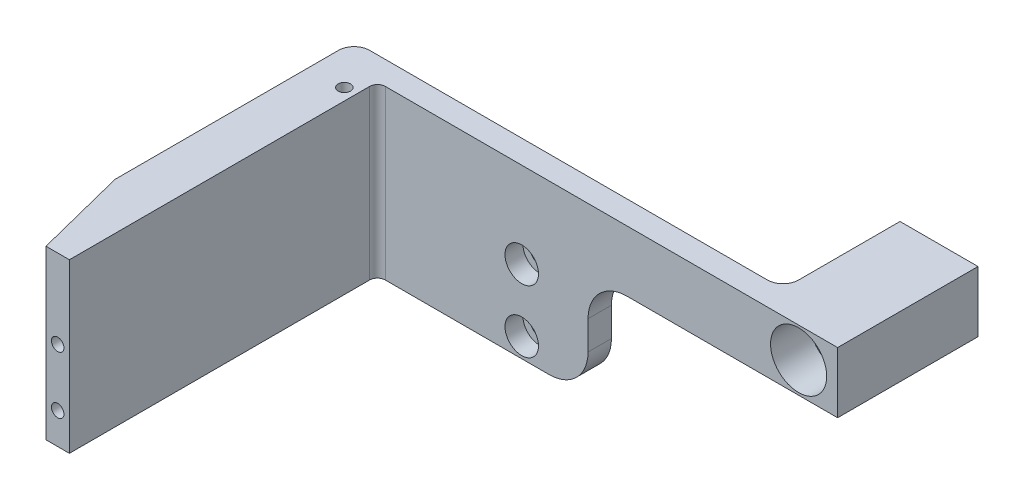
ISO-10303-21;
HEADER;
FILE_DESCRIPTION(('STEP AP214'),'2;1');
FILE_NAME('part.step','',(''),(''),'','','');
FILE_SCHEMA(('AUTOMOTIVE_DESIGN { 1 0 10303 214 1 1 1 1 }'));
ENDSEC;
DATA;
#1=APPLICATION_CONTEXT('core data for automotive mechanical design processes');
#2=APPLICATION_PROTOCOL_DEFINITION('international standard','automotive_design',2000,#1);
#3=PRODUCT_CONTEXT('',#1,'mechanical');
#4=PRODUCT('Part','Part','',(#3));
#5=PRODUCT_RELATED_PRODUCT_CATEGORY('part','',(#4));
#6=PRODUCT_DEFINITION_FORMATION('','',#4);
#7=PRODUCT_DEFINITION_CONTEXT('part definition',#1,'design');
#8=PRODUCT_DEFINITION('design','',#6,#7);
#9=PRODUCT_DEFINITION_SHAPE('','',#8);
#10=(LENGTH_UNIT() NAMED_UNIT(*) SI_UNIT(.MILLI.,.METRE.));
#11=(NAMED_UNIT(*) PLANE_ANGLE_UNIT() SI_UNIT($,.RADIAN.));
#12=(NAMED_UNIT(*) SI_UNIT($,.STERADIAN.) SOLID_ANGLE_UNIT());
#13=UNCERTAINTY_MEASURE_WITH_UNIT(LENGTH_MEASURE(1.E-05),#10,'distance_accuracy_value','');
#14=(GEOMETRIC_REPRESENTATION_CONTEXT(3) GLOBAL_UNCERTAINTY_ASSIGNED_CONTEXT((#13)) GLOBAL_UNIT_ASSIGNED_CONTEXT((#10,
#11,#12)) REPRESENTATION_CONTEXT('',''));
#15=CARTESIAN_POINT('',(0.,0.,0.));
#16=DIRECTION('',(0.,0.,1.));
#17=DIRECTION('',(1.,0.,0.));
#18=AXIS2_PLACEMENT_3D('',#15,#16,#17);
#19=CARTESIAN_POINT('',(0.,0.,3.));
#20=DIRECTION('',(0.,0.,1.));
#21=DIRECTION('',(1.,0.,0.));
#22=AXIS2_PLACEMENT_3D('',#19,#20,#21);
#23=PLANE('',#22);
#24=DIRECTION('',(-1.,0.,0.));
#25=VECTOR('',#24,1.);
#26=CARTESIAN_POINT('',(0.,-6.5,3.));
#27=LINE('',#26,#25);
#28=CARTESIAN_POINT('',(15.,-6.5,3.));
#29=VERTEX_POINT('',#28);
#30=CARTESIAN_POINT('',(-5.99999999999999,-6.5,3.));
#31=VERTEX_POINT('',#30);
#32=EDGE_CURVE('E311',#29,#31,#27,.T.);
#33=ORIENTED_EDGE('',*,*,#32,.F.);
#34=CARTESIAN_POINT('',(15.,-1.5,3.));
#35=DIRECTION('',(0.,0.,1.));
#36=DIRECTION('',(1.,0.,0.));
#37=AXIS2_PLACEMENT_3D('',#34,#35,#36);
#38=CIRCLE('',#37,5.);
#39=CARTESIAN_POINT('',(20.,-1.5,3.));
#40=VERTEX_POINT('',#39);
#41=EDGE_CURVE('E415',#29,#40,#38,.T.);
#42=ORIENTED_EDGE('',*,*,#41,.T.);
#43=DIRECTION('',(0.,-1.,0.));
#44=VECTOR('',#43,1.);
#45=CARTESIAN_POINT('',(20.,0.,3.));
#46=LINE('',#45,#44);
#47=CARTESIAN_POINT('',(20.,2.2,3.));
#48=VERTEX_POINT('',#47);
#49=EDGE_CURVE('E243',#48,#40,#46,.T.);
#50=ORIENTED_EDGE('',*,*,#49,.F.);
#51=CARTESIAN_POINT('',(25.,2.2,3.));
#52=DIRECTION('',(0.,0.,1.));
#53=DIRECTION('',(1.,0.,0.));
#54=AXIS2_PLACEMENT_3D('',#51,#52,#53);
#55=CIRCLE('',#54,5.);
#56=CARTESIAN_POINT('',(25.,7.2,3.));
#57=VERTEX_POINT('',#56);
#58=EDGE_CURVE('E11',#48,#57,#55,.F.);
#59=ORIENTED_EDGE('',*,*,#58,.T.);
#60=DIRECTION('',(-1.,0.,0.));
#61=VECTOR('',#60,1.);
#62=CARTESIAN_POINT('',(52.,7.2,3.));
#63=LINE('',#62,#61);
#64=CARTESIAN_POINT('',(52.,7.2,3.));
#65=VERTEX_POINT('',#64);
#66=EDGE_CURVE('E305',#65,#57,#63,.T.);
#67=ORIENTED_EDGE('',*,*,#66,.F.);
#68=DIRECTION('',(0.,-1.,0.));
#69=VECTOR('',#68,1.);
#70=CARTESIAN_POINT('',(52.,15.,3.));
#71=LINE('',#70,#69);
#72=CARTESIAN_POINT('',(52.,15.,3.));
#73=VERTEX_POINT('',#72);
#74=EDGE_CURVE('E295',#73,#65,#71,.T.);
#75=ORIENTED_EDGE('',*,*,#74,.F.);
#76=DIRECTION('',(1.,0.,0.));
#77=VECTOR('',#76,1.);
#78=CARTESIAN_POINT('',(20.,15.,3.));
#79=LINE('',#78,#77);
#80=CARTESIAN_POINT('',(-5.99999999999999,15.,3.));
#81=VERTEX_POINT('',#80);
#82=EDGE_CURVE('E351',#81,#73,#79,.T.);
#83=ORIENTED_EDGE('',*,*,#82,.F.);
#84=DIRECTION('',(0.,1.,0.));
#85=VECTOR('',#84,1.);
#86=CARTESIAN_POINT('',(-5.99999999999999,0.,3.));
#87=LINE('',#86,#85);
#88=EDGE_CURVE('E363',#81,#31,#87,.F.);
#89=ORIENTED_EDGE('',*,*,#88,.T.);
#90=EDGE_LOOP('',(#33,#42,#50,#59,#67,#75,#83,#89));
#91=FACE_BOUND('',#90,.T.);
#92=CARTESIAN_POINT('',(47.,11.1,3.));
#93=DIRECTION('',(0.,0.,1.));
#94=DIRECTION('',(1.,0.,0.));
#95=AXIS2_PLACEMENT_3D('',#92,#93,#94);
#96=CIRCLE('',#95,3.6);
#97=CARTESIAN_POINT('',(50.6,11.1,3.));
#98=VERTEX_POINT('',#97);
#99=EDGE_CURVE('E254',#98,#98,#96,.T.);
#100=ORIENTED_EDGE('',*,*,#99,.F.);
#101=EDGE_LOOP('',(#100));
#102=FACE_BOUND('',#101,.T.);
#103=CARTESIAN_POINT('',(11.5,4.,3.));
#104=DIRECTION('',(0.,0.,1.));
#105=DIRECTION('',(1.,0.,0.));
#106=AXIS2_PLACEMENT_3D('',#103,#104,#105);
#107=CIRCLE('',#106,2.15);
#108=CARTESIAN_POINT('',(13.65,4.,3.));
#109=VERTEX_POINT('',#108);
#110=EDGE_CURVE('E322',#109,#109,#107,.T.);
#111=ORIENTED_EDGE('',*,*,#110,.F.);
#112=EDGE_LOOP('',(#111));
#113=FACE_BOUND('',#112,.T.);
#114=CARTESIAN_POINT('',(11.5,-4.,3.));
#115=DIRECTION('',(0.,0.,1.));
#116=DIRECTION('',(1.,0.,0.));
#117=AXIS2_PLACEMENT_3D('',#114,#115,#116);
#118=CIRCLE('',#117,2.15);
#119=CARTESIAN_POINT('',(13.65,-4.,3.));
#120=VERTEX_POINT('',#119);
#121=EDGE_CURVE('E335',#120,#120,#118,.T.);
#122=ORIENTED_EDGE('',*,*,#121,.F.);
#123=EDGE_LOOP('',(#122));
#124=FACE_BOUND('',#123,.T.);
#125=ADVANCED_FACE('F46',(#91,#102,#113,#124),#23,.T.);
#126=CARTESIAN_POINT('',(0.,0.,0.));
#127=DIRECTION('',(0.,0.,1.));
#128=DIRECTION('',(1.,0.,0.));
#129=AXIS2_PLACEMENT_3D('',#126,#127,#128);
#130=PLANE('',#129);
#131=CARTESIAN_POINT('',(11.5,-4.,0.));
#132=DIRECTION('',(0.,0.,1.));
#133=DIRECTION('',(1.,0.,0.));
#134=AXIS2_PLACEMENT_3D('',#131,#132,#133);
#135=CIRCLE('',#134,1.2);
#136=CARTESIAN_POINT('',(12.7,-4.,0.));
#137=VERTEX_POINT('',#136);
#138=EDGE_CURVE('E346',#137,#137,#135,.T.);
#139=ORIENTED_EDGE('',*,*,#138,.T.);
#140=EDGE_LOOP('',(#139));
#141=FACE_BOUND('',#140,.T.);
#142=CARTESIAN_POINT('',(11.5,4.,0.));
#143=DIRECTION('',(0.,0.,1.));
#144=DIRECTION('',(1.,0.,0.));
#145=AXIS2_PLACEMENT_3D('',#142,#143,#144);
#146=CIRCLE('',#145,1.2);
#147=CARTESIAN_POINT('',(12.7,4.,0.));
#148=VERTEX_POINT('',#147);
#149=EDGE_CURVE('E334',#148,#148,#146,.T.);
#150=ORIENTED_EDGE('',*,*,#149,.T.);
#151=EDGE_LOOP('',(#150));
#152=FACE_BOUND('',#151,.T.);
#153=DIRECTION('',(0.,1.,0.));
#154=VECTOR('',#153,1.);
#155=CARTESIAN_POINT('',(20.,-6.5,0.));
#156=LINE('',#155,#154);
#157=CARTESIAN_POINT('',(20.,-1.5,0.));
#158=VERTEX_POINT('',#157);
#159=CARTESIAN_POINT('',(20.,2.2,0.));
#160=VERTEX_POINT('',#159);
#161=EDGE_CURVE('E236',#158,#160,#156,.T.);
#162=ORIENTED_EDGE('',*,*,#161,.F.);
#163=CARTESIAN_POINT('',(15.,-1.5,0.));
#164=DIRECTION('',(0.,0.,1.));
#165=DIRECTION('',(1.,0.,0.));
#166=AXIS2_PLACEMENT_3D('',#163,#164,#165);
#167=CIRCLE('',#166,5.);
#168=CARTESIAN_POINT('',(15.,-6.5,0.));
#169=VERTEX_POINT('',#168);
#170=EDGE_CURVE('E410',#158,#169,#167,.F.);
#171=ORIENTED_EDGE('',*,*,#170,.T.);
#172=DIRECTION('',(1.,0.,0.));
#173=VECTOR('',#172,1.);
#174=CARTESIAN_POINT('',(-20.,-6.5,0.));
#175=LINE('',#174,#173);
#176=CARTESIAN_POINT('',(-11.,-6.5,0.));
#177=VERTEX_POINT('',#176);
#178=EDGE_CURVE('E308',#177,#169,#175,.T.);
#179=ORIENTED_EDGE('',*,*,#178,.F.);
#180=DIRECTION('',(0.,1.,0.));
#181=VECTOR('',#180,1.);
#182=CARTESIAN_POINT('',(-11.,0.,0.));
#183=LINE('',#182,#181);
#184=CARTESIAN_POINT('',(-11.,15.,0.));
#185=VERTEX_POINT('',#184);
#186=EDGE_CURVE('E390',#177,#185,#183,.T.);
#187=ORIENTED_EDGE('',*,*,#186,.T.);
#188=DIRECTION('',(-1.,0.,0.));
#189=VECTOR('',#188,1.);
#190=CARTESIAN_POINT('',(-20.,15.,0.));
#191=LINE('',#190,#189);
#192=CARTESIAN_POINT('',(40.,15.,0.));
#193=VERTEX_POINT('',#192);
#194=EDGE_CURVE('E347',#193,#185,#191,.T.);
#195=ORIENTED_EDGE('',*,*,#194,.F.);
#196=DIRECTION('',(0.,1.,0.));
#197=VECTOR('',#196,1.);
#198=CARTESIAN_POINT('',(40.,7.2,0.));
#199=LINE('',#198,#197);
#200=CARTESIAN_POINT('',(40.,7.2,0.));
#201=VERTEX_POINT('',#200);
#202=EDGE_CURVE('E381',#193,#201,#199,.F.);
#203=ORIENTED_EDGE('',*,*,#202,.T.);
#204=DIRECTION('',(-1.,0.,0.));
#205=VECTOR('',#204,1.);
#206=CARTESIAN_POINT('',(52.,7.2,0.));
#207=LINE('',#206,#205);
#208=CARTESIAN_POINT('',(25.,7.2,0.));
#209=VERTEX_POINT('',#208);
#210=EDGE_CURVE('E301',#201,#209,#207,.T.);
#211=ORIENTED_EDGE('',*,*,#210,.T.);
#212=CARTESIAN_POINT('',(25.,2.2,0.));
#213=DIRECTION('',(0.,0.,1.));
#214=DIRECTION('',(1.,0.,0.));
#215=AXIS2_PLACEMENT_3D('',#212,#213,#214);
#216=CIRCLE('',#215,5.);
#217=EDGE_CURVE('E55',#209,#160,#216,.T.);
#218=ORIENTED_EDGE('',*,*,#217,.T.);
#219=EDGE_LOOP('',(#162,#171,#179,#187,#195,#203,#211,#218));
#220=FACE_BOUND('',#219,.T.);
#221=ADVANCED_FACE('F425',(#141,#152,#220),#130,.F.);
#222=CARTESIAN_POINT('',(-6.99999999999999,-5.,42.5));
#223=DIRECTION('',(-1.,0.,0.));
#224=DIRECTION('',(0.,0.,1.));
#225=AXIS2_PLACEMENT_3D('',#222,#223,#224);
#226=PLANE('',#225);
#227=DIRECTION('',(0.,1.,0.));
#228=VECTOR('',#227,1.);
#229=CARTESIAN_POINT('',(-6.99999999999999,-5.,42.5));
#230=LINE('',#229,#228);
#231=CARTESIAN_POINT('',(-6.99999999999999,-6.5,42.5));
#232=VERTEX_POINT('',#231);
#233=CARTESIAN_POINT('',(-7.,15.,42.5));
#234=VERTEX_POINT('',#233);
#235=EDGE_CURVE('E357',#232,#234,#230,.T.);
#236=ORIENTED_EDGE('',*,*,#235,.F.);
#237=DIRECTION('',(0.,0.,-1.));
#238=VECTOR('',#237,1.);
#239=CARTESIAN_POINT('',(-6.99999999999999,-6.5,4.));
#240=LINE('',#239,#238);
#241=CARTESIAN_POINT('',(-6.99999999999999,-6.5,4.));
#242=VERTEX_POINT('',#241);
#243=EDGE_CURVE('E207',#232,#242,#240,.T.);
#244=ORIENTED_EDGE('',*,*,#243,.T.);
#245=DIRECTION('',(0.,1.,0.));
#246=VECTOR('',#245,1.);
#247=CARTESIAN_POINT('',(-6.99999999999999,-5.,4.));
#248=LINE('',#247,#246);
#249=CARTESIAN_POINT('',(-7.,15.,4.));
#250=VERTEX_POINT('',#249);
#251=EDGE_CURVE('E360',#242,#250,#248,.T.);
#252=ORIENTED_EDGE('',*,*,#251,.T.);
#253=DIRECTION('',(0.,0.,1.));
#254=VECTOR('',#253,1.);
#255=CARTESIAN_POINT('',(-7.,15.,42.5));
#256=LINE('',#255,#254);
#257=EDGE_CURVE('E220',#250,#234,#256,.T.);
#258=ORIENTED_EDGE('',*,*,#257,.T.);
#259=EDGE_LOOP('',(#236,#244,#252,#258));
#260=FACE_BOUND('',#259,.T.);
#261=ADVANCED_FACE('F481',(#260),#226,.F.);
#262=CARTESIAN_POINT('',(0.,0.,42.5));
#263=DIRECTION('',(0.,0.,1.));
#264=DIRECTION('',(1.,0.,0.));
#265=AXIS2_PLACEMENT_3D('',#262,#263,#264);
#266=PLANE('',#265);
#267=CARTESIAN_POINT('',(-8.49999999999999,4.85427241713565,42.5));
#268=DIRECTION('',(0.,0.,1.));
#269=DIRECTION('',(1.,0.,0.));
#270=AXIS2_PLACEMENT_3D('',#267,#268,#269);
#271=CIRCLE('',#270,0.79999999999999);
#272=CARTESIAN_POINT('',(-7.7,4.85427241713565,42.5));
#273=VERTEX_POINT('',#272);
#274=EDGE_CURVE('E199',#273,#273,#271,.T.);
#275=ORIENTED_EDGE('',*,*,#274,.F.);
#276=EDGE_LOOP('',(#275));
#277=FACE_BOUND('',#276,.T.);
#278=CARTESIAN_POINT('',(-8.49999999999999,-2.49999999999989,42.5));
#279=DIRECTION('',(0.,0.,1.));
#280=DIRECTION('',(1.,0.,0.));
#281=AXIS2_PLACEMENT_3D('',#278,#279,#280);
#282=CIRCLE('',#281,0.799999999999999);
#283=CARTESIAN_POINT('',(-7.69999999999999,-2.49999999999989,42.5));
#284=VERTEX_POINT('',#283);
#285=EDGE_CURVE('E314',#284,#284,#282,.T.);
#286=ORIENTED_EDGE('',*,*,#285,.F.);
#287=EDGE_LOOP('',(#286));
#288=FACE_BOUND('',#287,.T.);
#289=ORIENTED_EDGE('',*,*,#235,.T.);
#290=DIRECTION('',(-1.,0.,0.));
#291=VECTOR('',#290,1.);
#292=CARTESIAN_POINT('',(-10.,15.,42.5));
#293=LINE('',#292,#291);
#294=CARTESIAN_POINT('',(-10.,15.,42.5));
#295=VERTEX_POINT('',#294);
#296=EDGE_CURVE('E224',#234,#295,#293,.T.);
#297=ORIENTED_EDGE('',*,*,#296,.T.);
#298=DIRECTION('',(0.,-1.,0.));
#299=VECTOR('',#298,1.);
#300=CARTESIAN_POINT('',(-9.99999999999999,5.,42.5));
#301=LINE('',#300,#299);
#302=CARTESIAN_POINT('',(-9.99999999999999,-6.5,42.5));
#303=VERTEX_POINT('',#302);
#304=EDGE_CURVE('E354',#295,#303,#301,.T.);
#305=ORIENTED_EDGE('',*,*,#304,.T.);
#306=DIRECTION('',(1.,0.,0.));
#307=VECTOR('',#306,1.);
#308=CARTESIAN_POINT('',(-6.99999999999999,-6.5,42.5));
#309=LINE('',#308,#307);
#310=EDGE_CURVE('E216',#303,#232,#309,.T.);
#311=ORIENTED_EDGE('',*,*,#310,.T.);
#312=EDGE_LOOP('',(#289,#297,#305,#311));
#313=FACE_BOUND('',#312,.T.);
#314=ADVANCED_FACE('F497',(#277,#288,#313),#266,.T.);
#315=CARTESIAN_POINT('',(-20.,-45.7461654637587,3.));
#316=DIRECTION('',(-0.969416374533033,0.,0.245421866970388));
#317=DIRECTION('',(0.245421866970388,0.,0.969416374533033));
#318=AXIS2_PLACEMENT_3D('',#315,#316,#317);
#319=PLANE('',#318);
#320=DIRECTION('',(0.,1.,0.));
#321=VECTOR('',#320,1.);
#322=CARTESIAN_POINT('',(-13.,-45.7461654637587,30.65));
#323=LINE('',#322,#321);
#324=CARTESIAN_POINT('',(-13.,-6.5,30.65));
#325=VERTEX_POINT('',#324);
#326=CARTESIAN_POINT('',(-13.,15.,30.65));
#327=VERTEX_POINT('',#326);
#328=EDGE_CURVE('E287',#325,#327,#323,.T.);
#329=ORIENTED_EDGE('',*,*,#328,.F.);
#330=DIRECTION('',(0.245421866970388,0.,0.969416374533033));
#331=VECTOR('',#330,1.);
#332=CARTESIAN_POINT('',(-9.99999999999999,-6.5,42.5));
#333=LINE('',#332,#331);
#334=EDGE_CURVE('E212',#325,#303,#333,.T.);
#335=ORIENTED_EDGE('',*,*,#334,.T.);
#336=ORIENTED_EDGE('',*,*,#304,.F.);
#337=DIRECTION('',(-0.245421866970388,0.,-0.969416374533033));
#338=VECTOR('',#337,1.);
#339=CARTESIAN_POINT('',(-13.,15.,30.65));
#340=LINE('',#339,#338);
#341=EDGE_CURVE('E228',#295,#327,#340,.T.);
#342=ORIENTED_EDGE('',*,*,#341,.T.);
#343=EDGE_LOOP('',(#329,#335,#336,#342));
#344=FACE_BOUND('',#343,.T.);
#345=ADVANCED_FACE('F488',(#344),#319,.T.);
#346=CARTESIAN_POINT('',(-5.99999999999999,-5.,4.));
#347=DIRECTION('',(0.,1.,0.));
#348=DIRECTION('',(0.,0.,1.));
#349=AXIS2_PLACEMENT_3D('',#346,#347,#348);
#350=CYLINDRICAL_SURFACE('',#349,1.);
#351=ORIENTED_EDGE('',*,*,#251,.F.);
#352=CARTESIAN_POINT('',(-5.99999999999999,-6.5,4.));
#353=DIRECTION('',(0.,1.,0.));
#354=DIRECTION('',(-1.,0.,0.));
#355=AXIS2_PLACEMENT_3D('',#352,#353,#354);
#356=CIRCLE('',#355,1.);
#357=EDGE_CURVE('E208',#242,#31,#356,.F.);
#358=ORIENTED_EDGE('',*,*,#357,.T.);
#359=ORIENTED_EDGE('',*,*,#88,.F.);
#360=CARTESIAN_POINT('',(-6.,15.,4.));
#361=DIRECTION('',(0.,-1.,0.));
#362=DIRECTION('',(1.,0.,0.));
#363=AXIS2_PLACEMENT_3D('',#360,#361,#362);
#364=CIRCLE('',#363,1.);
#365=EDGE_CURVE('E232',#81,#250,#364,.F.);
#366=ORIENTED_EDGE('',*,*,#365,.T.);
#367=EDGE_LOOP('',(#351,#358,#359,#366));
#368=FACE_BOUND('',#367,.T.);
#369=ADVANCED_FACE('F486',(#368),#350,.F.);
#370=CARTESIAN_POINT('',(0.,15.,0.));
#371=DIRECTION('',(0.,-1.,0.));
#372=DIRECTION('',(1.,0.,0.));
#373=AXIS2_PLACEMENT_3D('',#370,#371,#372);
#374=PLANE('',#373);
#375=CARTESIAN_POINT('',(-8.49999999999999,15.,5.74999999999998));
#376=DIRECTION('',(0.,1.,0.));
#377=DIRECTION('',(0.,0.,1.));
#378=AXIS2_PLACEMENT_3D('',#375,#376,#377);
#379=CIRCLE('',#378,0.79999999999999);
#380=CARTESIAN_POINT('',(-8.49999999999999,15.,6.54999999999997));
#381=VERTEX_POINT('',#380);
#382=EDGE_CURVE('E183',#381,#381,#379,.T.);
#383=ORIENTED_EDGE('',*,*,#382,.F.);
#384=EDGE_LOOP('',(#383));
#385=FACE_BOUND('',#384,.T.);
#386=ORIENTED_EDGE('',*,*,#194,.T.);
#387=CARTESIAN_POINT('',(-11.,15.,2.));
#388=DIRECTION('',(0.,-1.,0.));
#389=DIRECTION('',(1.,0.,0.));
#390=AXIS2_PLACEMENT_3D('',#387,#388,#389);
#391=CIRCLE('',#390,2.);
#392=CARTESIAN_POINT('',(-13.,15.,2.));
#393=VERTEX_POINT('',#392);
#394=EDGE_CURVE('E394',#185,#393,#391,.F.);
#395=ORIENTED_EDGE('',*,*,#394,.T.);
#396=DIRECTION('',(0.,0.,1.));
#397=VECTOR('',#396,1.);
#398=CARTESIAN_POINT('',(-13.,15.,0.));
#399=LINE('',#398,#397);
#400=EDGE_CURVE('E284',#393,#327,#399,.T.);
#401=ORIENTED_EDGE('',*,*,#400,.T.);
#402=ORIENTED_EDGE('',*,*,#341,.F.);
#403=ORIENTED_EDGE('',*,*,#296,.F.);
#404=ORIENTED_EDGE('',*,*,#257,.F.);
#405=ORIENTED_EDGE('',*,*,#365,.F.);
#406=ORIENTED_EDGE('',*,*,#82,.T.);
#407=DIRECTION('',(0.,0.,1.));
#408=VECTOR('',#407,1.);
#409=CARTESIAN_POINT('',(52.,15.,0.));
#410=LINE('',#409,#408);
#411=CARTESIAN_POINT('',(52.,15.,-15.));
#412=VERTEX_POINT('',#411);
#413=EDGE_CURVE('E291',#412,#73,#410,.T.);
#414=ORIENTED_EDGE('',*,*,#413,.F.);
#415=DIRECTION('',(1.,0.,0.));
#416=VECTOR('',#415,1.);
#417=CARTESIAN_POINT('',(42.,15.,-15.));
#418=LINE('',#417,#416);
#419=CARTESIAN_POINT('',(42.,15.,-15.));
#420=VERTEX_POINT('',#419);
#421=EDGE_CURVE('E272',#420,#412,#418,.T.);
#422=ORIENTED_EDGE('',*,*,#421,.F.);
#423=DIRECTION('',(0.,0.,1.));
#424=VECTOR('',#423,1.);
#425=CARTESIAN_POINT('',(42.,15.,-15.));
#426=LINE('',#425,#424);
#427=CARTESIAN_POINT('',(42.,15.,-2.));
#428=VERTEX_POINT('',#427);
#429=EDGE_CURVE('E276',#420,#428,#426,.T.);
#430=ORIENTED_EDGE('',*,*,#429,.T.);
#431=CARTESIAN_POINT('',(40.,15.,-2.));
#432=DIRECTION('',(0.,-1.,0.));
#433=DIRECTION('',(1.,0.,0.));
#434=AXIS2_PLACEMENT_3D('',#431,#432,#433);
#435=CIRCLE('',#434,2.);
#436=EDGE_CURVE('E384',#428,#193,#435,.T.);
#437=ORIENTED_EDGE('',*,*,#436,.T.);
#438=EDGE_LOOP('',(#386,#395,#401,#402,#403,#404,#405,#406,#414,#422,#430,#437));
#439=FACE_BOUND('',#438,.T.);
#440=ADVANCED_FACE('F446',(#385,#439),#374,.F.);
#441=CARTESIAN_POINT('',(11.5,-4.,3.));
#442=DIRECTION('',(0.,0.,1.));
#443=DIRECTION('',(1.,0.,0.));
#444=AXIS2_PLACEMENT_3D('',#441,#442,#443);
#445=CYLINDRICAL_SURFACE('',#444,1.2);
#446=CARTESIAN_POINT('',(11.5,-4.,0.7));
#447=DIRECTION('',(0.,0.,1.));
#448=DIRECTION('',(1.,0.,0.));
#449=AXIS2_PLACEMENT_3D('',#446,#447,#448);
#450=CIRCLE('',#449,1.2);
#451=CARTESIAN_POINT('',(12.7,-4.,0.7));
#452=VERTEX_POINT('',#451);
#453=EDGE_CURVE('E342',#452,#452,#450,.T.);
#454=ORIENTED_EDGE('',*,*,#453,.T.);
#455=EDGE_LOOP('',(#454));
#456=FACE_BOUND('',#455,.T.);
#457=ORIENTED_EDGE('',*,*,#138,.F.);
#458=EDGE_LOOP('',(#457));
#459=FACE_BOUND('',#458,.T.);
#460=ADVANCED_FACE('F494',(#456,#459),#445,.F.);
#461=CARTESIAN_POINT('',(12.7,-4.,0.7));
#462=DIRECTION('',(0.,0.,-1.));
#463=DIRECTION('',(-1.,0.,0.));
#464=AXIS2_PLACEMENT_3D('',#461,#462,#463);
#465=PLANE('',#464);
#466=ORIENTED_EDGE('',*,*,#453,.F.);
#467=EDGE_LOOP('',(#466));
#468=FACE_BOUND('',#467,.T.);
#469=CARTESIAN_POINT('',(11.5,-4.,0.7));
#470=DIRECTION('',(0.,0.,1.));
#471=DIRECTION('',(1.,0.,0.));
#472=AXIS2_PLACEMENT_3D('',#469,#470,#471);
#473=CIRCLE('',#472,2.15);
#474=CARTESIAN_POINT('',(13.65,-4.,0.7));
#475=VERTEX_POINT('',#474);
#476=EDGE_CURVE('E338',#475,#475,#473,.T.);
#477=ORIENTED_EDGE('',*,*,#476,.T.);
#478=EDGE_LOOP('',(#477));
#479=FACE_BOUND('',#478,.T.);
#480=ADVANCED_FACE('F556',(#468,#479),#465,.F.);
#481=CARTESIAN_POINT('',(11.5,-4.,3.));
#482=DIRECTION('',(0.,0.,1.));
#483=DIRECTION('',(1.,0.,0.));
#484=AXIS2_PLACEMENT_3D('',#481,#482,#483);
#485=CYLINDRICAL_SURFACE('',#484,2.15);
#486=ORIENTED_EDGE('',*,*,#476,.F.);
#487=EDGE_LOOP('',(#486));
#488=FACE_BOUND('',#487,.T.);
#489=ORIENTED_EDGE('',*,*,#121,.T.);
#490=EDGE_LOOP('',(#489));
#491=FACE_BOUND('',#490,.T.);
#492=ADVANCED_FACE('F552',(#488,#491),#485,.F.);
#493=CARTESIAN_POINT('',(11.5,4.,3.));
#494=DIRECTION('',(0.,0.,1.));
#495=DIRECTION('',(1.,0.,0.));
#496=AXIS2_PLACEMENT_3D('',#493,#494,#495);
#497=CYLINDRICAL_SURFACE('',#496,1.2);
#498=CARTESIAN_POINT('',(11.5,4.,0.7));
#499=DIRECTION('',(0.,0.,1.));
#500=DIRECTION('',(1.,0.,0.));
#501=AXIS2_PLACEMENT_3D('',#498,#499,#500);
#502=CIRCLE('',#501,1.2);
#503=CARTESIAN_POINT('',(12.7,4.,0.7));
#504=VERTEX_POINT('',#503);
#505=EDGE_CURVE('E330',#504,#504,#502,.T.);
#506=ORIENTED_EDGE('',*,*,#505,.T.);
#507=EDGE_LOOP('',(#506));
#508=FACE_BOUND('',#507,.T.);
#509=ORIENTED_EDGE('',*,*,#149,.F.);
#510=EDGE_LOOP('',(#509));
#511=FACE_BOUND('',#510,.T.);
#512=ADVANCED_FACE('F548',(#508,#511),#497,.F.);
#513=CARTESIAN_POINT('',(12.7,4.,0.7));
#514=DIRECTION('',(0.,0.,-1.));
#515=DIRECTION('',(-1.,0.,0.));
#516=AXIS2_PLACEMENT_3D('',#513,#514,#515);
#517=PLANE('',#516);
#518=ORIENTED_EDGE('',*,*,#505,.F.);
#519=EDGE_LOOP('',(#518));
#520=FACE_BOUND('',#519,.T.);
#521=CARTESIAN_POINT('',(11.5,4.,0.7));
#522=DIRECTION('',(0.,0.,1.));
#523=DIRECTION('',(1.,0.,0.));
#524=AXIS2_PLACEMENT_3D('',#521,#522,#523);
#525=CIRCLE('',#524,2.15);
#526=CARTESIAN_POINT('',(13.65,4.,0.7));
#527=VERTEX_POINT('',#526);
#528=EDGE_CURVE('E326',#527,#527,#525,.T.);
#529=ORIENTED_EDGE('',*,*,#528,.T.);
#530=EDGE_LOOP('',(#529));
#531=FACE_BOUND('',#530,.T.);
#532=ADVANCED_FACE('F544',(#520,#531),#517,.F.);
#533=CARTESIAN_POINT('',(11.5,4.,3.));
#534=DIRECTION('',(0.,0.,1.));
#535=DIRECTION('',(1.,0.,0.));
#536=AXIS2_PLACEMENT_3D('',#533,#534,#535);
#537=CYLINDRICAL_SURFACE('',#536,2.15);
#538=ORIENTED_EDGE('',*,*,#528,.F.);
#539=EDGE_LOOP('',(#538));
#540=FACE_BOUND('',#539,.T.);
#541=ORIENTED_EDGE('',*,*,#110,.T.);
#542=EDGE_LOOP('',(#541));
#543=FACE_BOUND('',#542,.T.);
#544=ADVANCED_FACE('F540',(#540,#543),#537,.F.);
#545=CARTESIAN_POINT('',(-8.49999999999999,-2.49999999999989,37.3));
#546=DIRECTION('',(0.,0.,1.));
#547=DIRECTION('',(1.,0.,0.));
#548=AXIS2_PLACEMENT_3D('',#545,#546,#547);
#549=CONICAL_SURFACE('',#548,0.799999999999998,1.02974425867666);
#550=CARTESIAN_POINT('',(-8.49999999999999,-2.49999999999989,36.819311504778));
#551=VERTEX_POINT('',#550);
#552=VERTEX_LOOP('',#551);
#553=FACE_BOUND('',#552,.T.);
#554=CARTESIAN_POINT('',(-8.49999999999999,-2.49999999999989,37.3));
#555=DIRECTION('',(0.,0.,1.));
#556=DIRECTION('',(1.,0.,0.));
#557=AXIS2_PLACEMENT_3D('',#554,#555,#556);
#558=CIRCLE('',#557,0.799999999999998);
#559=CARTESIAN_POINT('',(-7.69999999999999,-2.49999999999989,37.3));
#560=VERTEX_POINT('',#559);
#561=EDGE_CURVE('E318',#560,#560,#558,.T.);
#562=ORIENTED_EDGE('',*,*,#561,.T.);
#563=EDGE_LOOP('',(#562));
#564=FACE_BOUND('',#563,.T.);
#565=ADVANCED_FACE('F536',(#553,#564),#549,.F.);
#566=CARTESIAN_POINT('',(-8.49999999999999,-2.49999999999989,42.5));
#567=DIRECTION('',(0.,0.,1.));
#568=DIRECTION('',(1.,0.,0.));
#569=AXIS2_PLACEMENT_3D('',#566,#567,#568);
#570=CYLINDRICAL_SURFACE('',#569,0.799999999999998);
#571=ORIENTED_EDGE('',*,*,#561,.F.);
#572=EDGE_LOOP('',(#571));
#573=FACE_BOUND('',#572,.T.);
#574=ORIENTED_EDGE('',*,*,#285,.T.);
#575=EDGE_LOOP('',(#574));
#576=FACE_BOUND('',#575,.T.);
#577=ADVANCED_FACE('F532',(#573,#576),#570,.F.);
#578=CARTESIAN_POINT('',(-20.,-6.5,42.5));
#579=DIRECTION('',(0.,1.,0.));
#580=DIRECTION('',(-1.,0.,0.));
#581=AXIS2_PLACEMENT_3D('',#578,#579,#580);
#582=PLANE('',#581);
#583=CARTESIAN_POINT('',(-8.49999999999999,-6.5,5.74999999999998));
#584=DIRECTION('',(0.,-1.,0.));
#585=DIRECTION('',(0.,0.,-1.));
#586=AXIS2_PLACEMENT_3D('',#583,#584,#585);
#587=CIRCLE('',#586,0.79999999999999);
#588=CARTESIAN_POINT('',(-8.49999999999999,-6.5,4.94999999999999));
#589=VERTEX_POINT('',#588);
#590=EDGE_CURVE('E182',#589,#589,#587,.T.);
#591=ORIENTED_EDGE('',*,*,#590,.F.);
#592=EDGE_LOOP('',(#591));
#593=FACE_BOUND('',#592,.T.);
#594=ORIENTED_EDGE('',*,*,#178,.T.);
#595=DIRECTION('',(0.,0.,-1.));
#596=VECTOR('',#595,1.);
#597=CARTESIAN_POINT('',(15.,-6.5,42.5));
#598=LINE('',#597,#596);
#599=EDGE_CURVE('E68',#169,#29,#598,.F.);
#600=ORIENTED_EDGE('',*,*,#599,.T.);
#601=ORIENTED_EDGE('',*,*,#32,.T.);
#602=ORIENTED_EDGE('',*,*,#357,.F.);
#603=ORIENTED_EDGE('',*,*,#243,.F.);
#604=ORIENTED_EDGE('',*,*,#310,.F.);
#605=ORIENTED_EDGE('',*,*,#334,.F.);
#606=DIRECTION('',(0.,0.,-1.));
#607=VECTOR('',#606,1.);
#608=CARTESIAN_POINT('',(-13.,-6.5,42.5));
#609=LINE('',#608,#607);
#610=CARTESIAN_POINT('',(-13.,-6.5,2.));
#611=VERTEX_POINT('',#610);
#612=EDGE_CURVE('E367',#325,#611,#609,.T.);
#613=ORIENTED_EDGE('',*,*,#612,.T.);
#614=CARTESIAN_POINT('',(-11.,-6.5,2.));
#615=DIRECTION('',(0.,1.,0.));
#616=DIRECTION('',(-1.,0.,0.));
#617=AXIS2_PLACEMENT_3D('',#614,#615,#616);
#618=CIRCLE('',#617,2.);
#619=EDGE_CURVE('E400',#611,#177,#618,.F.);
#620=ORIENTED_EDGE('',*,*,#619,.T.);
#621=EDGE_LOOP('',(#594,#600,#601,#602,#603,#604,#605,#613,#620));
#622=FACE_BOUND('',#621,.T.);
#623=ADVANCED_FACE('F504',(#593,#622),#582,.F.);
#624=CARTESIAN_POINT('',(52.,7.2,3.));
#625=DIRECTION('',(0.,1.,0.));
#626=DIRECTION('',(0.,0.,1.));
#627=AXIS2_PLACEMENT_3D('',#624,#625,#626);
#628=PLANE('',#627);
#629=ORIENTED_EDGE('',*,*,#66,.T.);
#630=DIRECTION('',(0.,0.,-1.));
#631=VECTOR('',#630,1.);
#632=CARTESIAN_POINT('',(25.,7.2,0.));
#633=LINE('',#632,#631);
#634=EDGE_CURVE('E418',#57,#209,#633,.T.);
#635=ORIENTED_EDGE('',*,*,#634,.T.);
#636=ORIENTED_EDGE('',*,*,#210,.F.);
#637=CARTESIAN_POINT('',(40.,7.2,-2.));
#638=DIRECTION('',(0.,1.,0.));
#639=DIRECTION('',(0.,0.,1.));
#640=AXIS2_PLACEMENT_3D('',#637,#638,#639);
#641=CIRCLE('',#640,2.);
#642=CARTESIAN_POINT('',(42.,7.2,-2.));
#643=VERTEX_POINT('',#642);
#644=EDGE_CURVE('E387',#201,#643,#641,.T.);
#645=ORIENTED_EDGE('',*,*,#644,.T.);
#646=DIRECTION('',(0.,0.,1.));
#647=VECTOR('',#646,1.);
#648=CARTESIAN_POINT('',(42.,7.2,-15.));
#649=LINE('',#648,#647);
#650=CARTESIAN_POINT('',(42.,7.2,-15.));
#651=VERTEX_POINT('',#650);
#652=EDGE_CURVE('E280',#651,#643,#649,.T.);
#653=ORIENTED_EDGE('',*,*,#652,.F.);
#654=DIRECTION('',(-1.,0.,0.));
#655=VECTOR('',#654,1.);
#656=CARTESIAN_POINT('',(52.,7.2,-15.));
#657=LINE('',#656,#655);
#658=CARTESIAN_POINT('',(52.,7.2,-15.));
#659=VERTEX_POINT('',#658);
#660=EDGE_CURVE('E266',#659,#651,#657,.T.);
#661=ORIENTED_EDGE('',*,*,#660,.F.);
#662=DIRECTION('',(0.,0.,-1.));
#663=VECTOR('',#662,1.);
#664=CARTESIAN_POINT('',(52.,7.2,3.));
#665=LINE('',#664,#663);
#666=EDGE_CURVE('E298',#65,#659,#665,.T.);
#667=ORIENTED_EDGE('',*,*,#666,.F.);
#668=EDGE_LOOP('',(#629,#635,#636,#645,#653,#661,#667));
#669=FACE_BOUND('',#668,.T.);
#670=ADVANCED_FACE('F434',(#669),#628,.F.);
#671=CARTESIAN_POINT('',(52.,0.,0.));
#672=DIRECTION('',(1.,0.,0.));
#673=DIRECTION('',(0.,0.,-1.));
#674=AXIS2_PLACEMENT_3D('',#671,#672,#673);
#675=PLANE('',#674);
#676=ORIENTED_EDGE('',*,*,#666,.T.);
#677=DIRECTION('',(0.,-1.,0.));
#678=VECTOR('',#677,1.);
#679=CARTESIAN_POINT('',(52.,15.,-15.));
#680=LINE('',#679,#678);
#681=EDGE_CURVE('E259',#412,#659,#680,.T.);
#682=ORIENTED_EDGE('',*,*,#681,.F.);
#683=ORIENTED_EDGE('',*,*,#413,.T.);
#684=ORIENTED_EDGE('',*,*,#74,.T.);
#685=EDGE_LOOP('',(#676,#682,#683,#684));
#686=FACE_BOUND('',#685,.T.);
#687=ADVANCED_FACE('F442',(#686),#675,.T.);
#688=CARTESIAN_POINT('',(-13.,-30.,42.2390948300837));
#689=DIRECTION('',(1.,0.,0.));
#690=DIRECTION('',(0.,0.,-1.));
#691=AXIS2_PLACEMENT_3D('',#688,#689,#690);
#692=PLANE('',#691);
#693=ORIENTED_EDGE('',*,*,#400,.F.);
#694=DIRECTION('',(0.,1.,0.));
#695=VECTOR('',#694,1.);
#696=CARTESIAN_POINT('',(-13.,-30.,2.));
#697=LINE('',#696,#695);
#698=EDGE_CURVE('E397',#393,#611,#697,.F.);
#699=ORIENTED_EDGE('',*,*,#698,.T.);
#700=ORIENTED_EDGE('',*,*,#612,.F.);
#701=ORIENTED_EDGE('',*,*,#328,.T.);
#702=EDGE_LOOP('',(#693,#699,#700,#701));
#703=FACE_BOUND('',#702,.T.);
#704=ADVANCED_FACE('F517',(#703),#692,.F.);
#705=CARTESIAN_POINT('',(42.,7.2,-15.));
#706=DIRECTION('',(1.,0.,0.));
#707=DIRECTION('',(0.,0.,-1.));
#708=AXIS2_PLACEMENT_3D('',#705,#706,#707);
#709=PLANE('',#708);
#710=ORIENTED_EDGE('',*,*,#652,.T.);
#711=DIRECTION('',(0.,1.,0.));
#712=VECTOR('',#711,1.);
#713=CARTESIAN_POINT('',(42.,15.,-2.));
#714=LINE('',#713,#712);
#715=EDGE_CURVE('E377',#643,#428,#714,.T.);
#716=ORIENTED_EDGE('',*,*,#715,.T.);
#717=ORIENTED_EDGE('',*,*,#429,.F.);
#718=DIRECTION('',(0.,1.,0.));
#719=VECTOR('',#718,1.);
#720=CARTESIAN_POINT('',(42.,7.2,-15.));
#721=LINE('',#720,#719);
#722=EDGE_CURVE('E269',#651,#420,#721,.T.);
#723=ORIENTED_EDGE('',*,*,#722,.F.);
#724=EDGE_LOOP('',(#710,#716,#717,#723));
#725=FACE_BOUND('',#724,.T.);
#726=ADVANCED_FACE('F454',(#725),#709,.F.);
#727=CARTESIAN_POINT('',(0.,0.,-15.));
#728=DIRECTION('',(0.,0.,-1.));
#729=DIRECTION('',(-1.,0.,0.));
#730=AXIS2_PLACEMENT_3D('',#727,#728,#729);
#731=PLANE('',#730);
#732=CARTESIAN_POINT('',(47.,11.1,-15.));
#733=DIRECTION('',(0.,0.,1.));
#734=DIRECTION('',(1.,0.,0.));
#735=AXIS2_PLACEMENT_3D('',#732,#733,#734);
#736=CIRCLE('',#735,1.65);
#737=CARTESIAN_POINT('',(48.65,11.1,-15.));
#738=VERTEX_POINT('',#737);
#739=EDGE_CURVE('E251',#738,#738,#736,.T.);
#740=ORIENTED_EDGE('',*,*,#739,.T.);
#741=EDGE_LOOP('',(#740));
#742=FACE_BOUND('',#741,.T.);
#743=ORIENTED_EDGE('',*,*,#681,.T.);
#744=ORIENTED_EDGE('',*,*,#660,.T.);
#745=ORIENTED_EDGE('',*,*,#722,.T.);
#746=ORIENTED_EDGE('',*,*,#421,.T.);
#747=EDGE_LOOP('',(#743,#744,#745,#746));
#748=FACE_BOUND('',#747,.T.);
#749=ADVANCED_FACE('F449',(#742,#748),#731,.T.);
#750=CARTESIAN_POINT('',(47.,11.1,-2.));
#751=DIRECTION('',(0.,0.,1.));
#752=DIRECTION('',(1.,0.,0.));
#753=AXIS2_PLACEMENT_3D('',#750,#751,#752);
#754=CYLINDRICAL_SURFACE('',#753,3.6);
#755=CARTESIAN_POINT('',(47.,11.1,-2.));
#756=DIRECTION('',(0.,0.,1.));
#757=DIRECTION('',(1.,0.,0.));
#758=AXIS2_PLACEMENT_3D('',#755,#756,#757);
#759=CIRCLE('',#758,3.6);
#760=CARTESIAN_POINT('',(50.6,11.1,-2.));
#761=VERTEX_POINT('',#760);
#762=EDGE_CURVE('E255',#761,#761,#759,.T.);
#763=ORIENTED_EDGE('',*,*,#762,.F.);
#764=EDGE_LOOP('',(#763));
#765=FACE_BOUND('',#764,.T.);
#766=ORIENTED_EDGE('',*,*,#99,.T.);
#767=EDGE_LOOP('',(#766));
#768=FACE_BOUND('',#767,.T.);
#769=ADVANCED_FACE('F591',(#765,#768),#754,.F.);
#770=CARTESIAN_POINT('',(47.,11.1,-2.));
#771=DIRECTION('',(0.,0.,1.));
#772=DIRECTION('',(1.,0.,0.));
#773=AXIS2_PLACEMENT_3D('',#770,#771,#772);
#774=PLANE('',#773);
#775=CARTESIAN_POINT('',(47.,11.1,-2.));
#776=DIRECTION('',(0.,0.,1.));
#777=DIRECTION('',(1.,0.,0.));
#778=AXIS2_PLACEMENT_3D('',#775,#776,#777);
#779=CIRCLE('',#778,1.65);
#780=CARTESIAN_POINT('',(48.65,11.1,-2.));
#781=VERTEX_POINT('',#780);
#782=EDGE_CURVE('E247',#781,#781,#779,.T.);
#783=ORIENTED_EDGE('',*,*,#782,.F.);
#784=EDGE_LOOP('',(#783));
#785=FACE_BOUND('',#784,.T.);
#786=ORIENTED_EDGE('',*,*,#762,.T.);
#787=EDGE_LOOP('',(#786));
#788=FACE_BOUND('',#787,.T.);
#789=ADVANCED_FACE('F471',(#785,#788),#774,.T.);
#790=CARTESIAN_POINT('',(47.,11.1,-2.));
#791=DIRECTION('',(0.,0.,1.));
#792=DIRECTION('',(1.,0.,0.));
#793=AXIS2_PLACEMENT_3D('',#790,#791,#792);
#794=CYLINDRICAL_SURFACE('',#793,1.65);
#795=ORIENTED_EDGE('',*,*,#739,.F.);
#796=EDGE_LOOP('',(#795));
#797=FACE_BOUND('',#796,.T.);
#798=ORIENTED_EDGE('',*,*,#782,.T.);
#799=EDGE_LOOP('',(#798));
#800=FACE_BOUND('',#799,.T.);
#801=ADVANCED_FACE('F463',(#797,#800),#794,.F.);
#802=CARTESIAN_POINT('',(40.,7.2,-2.));
#803=DIRECTION('',(0.,-1.,0.));
#804=DIRECTION('',(0.,0.,-1.));
#805=AXIS2_PLACEMENT_3D('',#802,#803,#804);
#806=CYLINDRICAL_SURFACE('',#805,2.);
#807=ORIENTED_EDGE('',*,*,#644,.F.);
#808=ORIENTED_EDGE('',*,*,#202,.F.);
#809=ORIENTED_EDGE('',*,*,#436,.F.);
#810=ORIENTED_EDGE('',*,*,#715,.F.);
#811=EDGE_LOOP('',(#807,#808,#809,#810));
#812=FACE_BOUND('',#811,.T.);
#813=ADVANCED_FACE('F461',(#812),#806,.F.);
#814=CARTESIAN_POINT('',(20.,-6.5,8.));
#815=DIRECTION('',(-1.,0.,0.));
#816=DIRECTION('',(0.,0.,1.));
#817=AXIS2_PLACEMENT_3D('',#814,#815,#816);
#818=PLANE('',#817);
#819=ORIENTED_EDGE('',*,*,#49,.T.);
#820=DIRECTION('',(0.,0.,-1.));
#821=VECTOR('',#820,1.);
#822=CARTESIAN_POINT('',(20.,-1.5,8.));
#823=LINE('',#822,#821);
#824=EDGE_CURVE('E406',#40,#158,#823,.T.);
#825=ORIENTED_EDGE('',*,*,#824,.T.);
#826=ORIENTED_EDGE('',*,*,#161,.T.);
#827=DIRECTION('',(0.,0.,-1.));
#828=VECTOR('',#827,1.);
#829=CARTESIAN_POINT('',(20.,2.2,3.));
#830=LINE('',#829,#828);
#831=EDGE_CURVE('E403',#160,#48,#830,.F.);
#832=ORIENTED_EDGE('',*,*,#831,.T.);
#833=EDGE_LOOP('',(#819,#825,#826,#832));
#834=FACE_BOUND('',#833,.T.);
#835=ADVANCED_FACE('F431',(#834),#818,.F.);
#836=CARTESIAN_POINT('',(-8.49999999999999,4.85427241713565,37.3));
#837=DIRECTION('',(0.,0.,1.));
#838=DIRECTION('',(1.,0.,0.));
#839=AXIS2_PLACEMENT_3D('',#836,#837,#838);
#840=CONICAL_SURFACE('',#839,0.799999999999988,1.02974425867664);
#841=CARTESIAN_POINT('',(-8.49999999999999,4.85427241713565,36.819311504778));
#842=VERTEX_POINT('',#841);
#843=VERTEX_LOOP('',#842);
#844=FACE_BOUND('',#843,.T.);
#845=CARTESIAN_POINT('',(-8.49999999999999,4.85427241713565,37.3));
#846=DIRECTION('',(0.,0.,1.));
#847=DIRECTION('',(1.,0.,0.));
#848=AXIS2_PLACEMENT_3D('',#845,#846,#847);
#849=CIRCLE('',#848,0.799999999999988);
#850=CARTESIAN_POINT('',(-7.7,4.85427241713565,37.3));
#851=VERTEX_POINT('',#850);
#852=EDGE_CURVE('E203',#851,#851,#849,.T.);
#853=ORIENTED_EDGE('',*,*,#852,.T.);
#854=EDGE_LOOP('',(#853));
#855=FACE_BOUND('',#854,.T.);
#856=ADVANCED_FACE('F469',(#844,#855),#840,.F.);
#857=CARTESIAN_POINT('',(-8.49999999999999,4.85427241713565,42.5));
#858=DIRECTION('',(0.,0.,1.));
#859=DIRECTION('',(1.,0.,0.));
#860=AXIS2_PLACEMENT_3D('',#857,#858,#859);
#861=CYLINDRICAL_SURFACE('',#860,0.799999999999989);
#862=ORIENTED_EDGE('',*,*,#852,.F.);
#863=EDGE_LOOP('',(#862));
#864=FACE_BOUND('',#863,.T.);
#865=ORIENTED_EDGE('',*,*,#274,.T.);
#866=EDGE_LOOP('',(#865));
#867=FACE_BOUND('',#866,.T.);
#868=ADVANCED_FACE('F573',(#864,#867),#861,.F.);
#869=CARTESIAN_POINT('',(-8.49999999999999,-1.3,5.74999999999998));
#870=DIRECTION('',(0.,-1.,0.));
#871=DIRECTION('',(0.,0.,-1.));
#872=AXIS2_PLACEMENT_3D('',#869,#870,#871);
#873=CONICAL_SURFACE('',#872,0.799999999999988,1.02974425867664);
#874=CARTESIAN_POINT('',(-8.49999999999999,-0.819311504777949,5.74999999999998));
#875=VERTEX_POINT('',#874);
#876=VERTEX_LOOP('',#875);
#877=FACE_BOUND('',#876,.T.);
#878=CARTESIAN_POINT('',(-8.49999999999999,-1.3,5.74999999999998));
#879=DIRECTION('',(0.,-1.,0.));
#880=DIRECTION('',(0.,0.,-1.));
#881=AXIS2_PLACEMENT_3D('',#878,#879,#880);
#882=CIRCLE('',#881,0.799999999999988);
#883=CARTESIAN_POINT('',(-8.49999999999999,-1.3,4.95));
#884=VERTEX_POINT('',#883);
#885=EDGE_CURVE('E190',#884,#884,#882,.T.);
#886=ORIENTED_EDGE('',*,*,#885,.T.);
#887=EDGE_LOOP('',(#886));
#888=FACE_BOUND('',#887,.T.);
#889=ADVANCED_FACE('F575',(#877,#888),#873,.F.);
#890=CARTESIAN_POINT('',(-8.49999999999999,-6.5,5.74999999999998));
#891=DIRECTION('',(0.,-1.,0.));
#892=DIRECTION('',(0.,0.,-1.));
#893=AXIS2_PLACEMENT_3D('',#890,#891,#892);
#894=CYLINDRICAL_SURFACE('',#893,0.799999999999989);
#895=ORIENTED_EDGE('',*,*,#885,.F.);
#896=EDGE_LOOP('',(#895));
#897=FACE_BOUND('',#896,.T.);
#898=ORIENTED_EDGE('',*,*,#590,.T.);
#899=EDGE_LOOP('',(#898));
#900=FACE_BOUND('',#899,.T.);
#901=ADVANCED_FACE('F175',(#897,#900),#894,.F.);
#902=CARTESIAN_POINT('',(-8.49999999999999,9.8,5.74999999999998));
#903=DIRECTION('',(0.,1.,0.));
#904=DIRECTION('',(0.,0.,1.));
#905=AXIS2_PLACEMENT_3D('',#902,#903,#904);
#906=CONICAL_SURFACE('',#905,0.799999999999988,1.02974425867664);
#907=CARTESIAN_POINT('',(-8.49999999999999,9.31931150477795,5.74999999999998));
#908=VERTEX_POINT('',#907);
#909=VERTEX_LOOP('',#908);
#910=FACE_BOUND('',#909,.T.);
#911=CARTESIAN_POINT('',(-8.49999999999999,9.8,5.74999999999998));
#912=DIRECTION('',(0.,1.,0.));
#913=DIRECTION('',(0.,0.,1.));
#914=AXIS2_PLACEMENT_3D('',#911,#912,#913);
#915=CIRCLE('',#914,0.799999999999988);
#916=CARTESIAN_POINT('',(-8.49999999999999,9.8,6.54999999999997));
#917=VERTEX_POINT('',#916);
#918=EDGE_CURVE('E179',#917,#917,#915,.T.);
#919=ORIENTED_EDGE('',*,*,#918,.T.);
#920=EDGE_LOOP('',(#919));
#921=FACE_BOUND('',#920,.T.);
#922=ADVANCED_FACE('F171',(#910,#921),#906,.F.);
#923=CARTESIAN_POINT('',(-8.49999999999999,15.,5.74999999999998));
#924=DIRECTION('',(0.,1.,0.));
#925=DIRECTION('',(0.,0.,1.));
#926=AXIS2_PLACEMENT_3D('',#923,#924,#925);
#927=CYLINDRICAL_SURFACE('',#926,0.799999999999989);
#928=ORIENTED_EDGE('',*,*,#918,.F.);
#929=EDGE_LOOP('',(#928));
#930=FACE_BOUND('',#929,.T.);
#931=ORIENTED_EDGE('',*,*,#382,.T.);
#932=EDGE_LOOP('',(#931));
#933=FACE_BOUND('',#932,.T.);
#934=ADVANCED_FACE('F174',(#930,#933),#927,.F.);
#935=CARTESIAN_POINT('',(-11.,0.,2.));
#936=DIRECTION('',(0.,1.,0.));
#937=DIRECTION('',(0.,0.,1.));
#938=AXIS2_PLACEMENT_3D('',#935,#936,#937);
#939=CYLINDRICAL_SURFACE('',#938,2.);
#940=ORIENTED_EDGE('',*,*,#619,.F.);
#941=ORIENTED_EDGE('',*,*,#698,.F.);
#942=ORIENTED_EDGE('',*,*,#394,.F.);
#943=ORIENTED_EDGE('',*,*,#186,.F.);
#944=EDGE_LOOP('',(#940,#941,#942,#943));
#945=FACE_BOUND('',#944,.T.);
#946=ADVANCED_FACE('F516',(#945),#939,.T.);
#947=CARTESIAN_POINT('',(15.,-1.5,8.));
#948=DIRECTION('',(0.,0.,-1.));
#949=DIRECTION('',(-1.,0.,0.));
#950=AXIS2_PLACEMENT_3D('',#947,#948,#949);
#951=CYLINDRICAL_SURFACE('',#950,5.);
#952=ORIENTED_EDGE('',*,*,#41,.F.);
#953=ORIENTED_EDGE('',*,*,#599,.F.);
#954=ORIENTED_EDGE('',*,*,#170,.F.);
#955=ORIENTED_EDGE('',*,*,#824,.F.);
#956=EDGE_LOOP('',(#952,#953,#954,#955));
#957=FACE_BOUND('',#956,.T.);
#958=ADVANCED_FACE('F681',(#957),#951,.T.);
#959=CARTESIAN_POINT('',(25.,2.2,3.));
#960=DIRECTION('',(0.,0.,1.));
#961=DIRECTION('',(1.,0.,0.));
#962=AXIS2_PLACEMENT_3D('',#959,#960,#961);
#963=CYLINDRICAL_SURFACE('',#962,5.);
#964=ORIENTED_EDGE('',*,*,#58,.F.);
#965=ORIENTED_EDGE('',*,*,#831,.F.);
#966=ORIENTED_EDGE('',*,*,#217,.F.);
#967=ORIENTED_EDGE('',*,*,#634,.F.);
#968=EDGE_LOOP('',(#964,#965,#966,#967));
#969=FACE_BOUND('',#968,.T.);
#970=ADVANCED_FACE('F48',(#969),#963,.F.);
#971=CLOSED_SHELL('',(#125,#221,#261,#314,#345,#369,#440,#460,#480,#492,#512,#532,#544,#565,
#577,#623,#670,#687,#704,#726,#749,#769,#789,#801,#813,#835,#856,#868,#889,#901,#922,#934,#946,
#958,#970));
#972=MANIFOLD_SOLID_BREP('B2',#971);
#973=ADVANCED_BREP_SHAPE_REPRESENTATION('',(#18,#972),#14);
#974=SHAPE_DEFINITION_REPRESENTATION(#9,#973);
ENDSEC;
END-ISO-10303-21;
